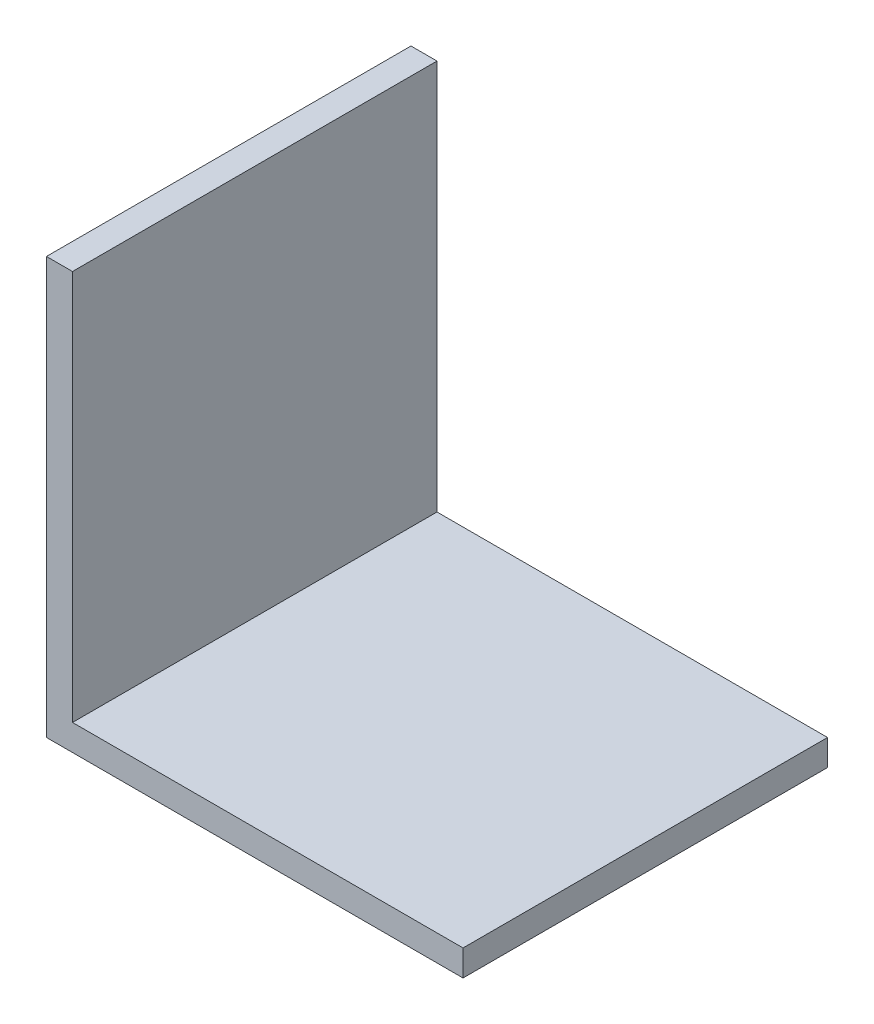
ISO-10303-21;
HEADER;
FILE_DESCRIPTION(('STEP AP214'),'2;1');
FILE_NAME('part.step','',(''),(''),'','','');
FILE_SCHEMA(('AUTOMOTIVE_DESIGN { 1 0 10303 214 1 1 1 1 }'));
ENDSEC;
DATA;
#1=APPLICATION_CONTEXT('core data for automotive mechanical design processes');
#2=APPLICATION_PROTOCOL_DEFINITION('international standard','automotive_design',2000,#1);
#3=PRODUCT_CONTEXT('',#1,'mechanical');
#4=PRODUCT('Part','Part','',(#3));
#5=PRODUCT_RELATED_PRODUCT_CATEGORY('part','',(#4));
#6=PRODUCT_DEFINITION_FORMATION('','',#4);
#7=PRODUCT_DEFINITION_CONTEXT('part definition',#1,'design');
#8=PRODUCT_DEFINITION('design','',#6,#7);
#9=PRODUCT_DEFINITION_SHAPE('','',#8);
#10=(LENGTH_UNIT() NAMED_UNIT(*) SI_UNIT(.MILLI.,.METRE.));
#11=(NAMED_UNIT(*) PLANE_ANGLE_UNIT() SI_UNIT($,.RADIAN.));
#12=(NAMED_UNIT(*) SI_UNIT($,.STERADIAN.) SOLID_ANGLE_UNIT());
#13=UNCERTAINTY_MEASURE_WITH_UNIT(LENGTH_MEASURE(1.E-05),#10,'distance_accuracy_value','');
#14=(GEOMETRIC_REPRESENTATION_CONTEXT(3) GLOBAL_UNCERTAINTY_ASSIGNED_CONTEXT((#13)) GLOBAL_UNIT_ASSIGNED_CONTEXT((#10,
#11,#12)) REPRESENTATION_CONTEXT('',''));
#15=CARTESIAN_POINT('',(0.,0.,0.));
#16=DIRECTION('',(0.,0.,1.));
#17=DIRECTION('',(1.,0.,0.));
#18=AXIS2_PLACEMENT_3D('',#15,#16,#17);
#19=CARTESIAN_POINT('',(76.2,0.,33.3375));
#20=DIRECTION('',(0.,1.,0.));
#21=DIRECTION('',(-1.,0.,0.));
#22=AXIS2_PLACEMENT_3D('',#19,#20,#21);
#23=PLANE('',#22);
#24=DIRECTION('',(1.,0.,0.));
#25=VECTOR('',#24,1.);
#26=CARTESIAN_POINT('',(76.2,0.,-33.3375));
#27=LINE('',#26,#25);
#28=CARTESIAN_POINT('',(0.,0.,-33.3375));
#29=VERTEX_POINT('',#28);
#30=CARTESIAN_POINT('',(76.2,0.,-33.3375));
#31=VERTEX_POINT('',#30);
#32=EDGE_CURVE('E118',#29,#31,#27,.T.);
#33=ORIENTED_EDGE('',*,*,#32,.T.);
#34=DIRECTION('',(0.,0.,-1.));
#35=VECTOR('',#34,1.);
#36=CARTESIAN_POINT('',(76.2,0.,33.3375));
#37=LINE('',#36,#35);
#38=CARTESIAN_POINT('',(76.2,0.,33.3375));
#39=VERTEX_POINT('',#38);
#40=EDGE_CURVE('E11',#39,#31,#37,.T.);
#41=ORIENTED_EDGE('',*,*,#40,.F.);
#42=DIRECTION('',(1.,0.,0.));
#43=VECTOR('',#42,1.);
#44=CARTESIAN_POINT('',(76.2,0.,33.3375));
#45=LINE('',#44,#43);
#46=CARTESIAN_POINT('',(0.,0.,33.3375));
#47=VERTEX_POINT('',#46);
#48=EDGE_CURVE('E128',#47,#39,#45,.T.);
#49=ORIENTED_EDGE('',*,*,#48,.F.);
#50=DIRECTION('',(0.,0.,-1.));
#51=VECTOR('',#50,1.);
#52=CARTESIAN_POINT('',(0.,0.,33.3375));
#53=LINE('',#52,#51);
#54=EDGE_CURVE('E114',#47,#29,#53,.T.);
#55=ORIENTED_EDGE('',*,*,#54,.T.);
#56=EDGE_LOOP('',(#33,#41,#49,#55));
#57=FACE_BOUND('',#56,.T.);
#58=ADVANCED_FACE('F34',(#57),#23,.F.);
#59=CARTESIAN_POINT('',(76.2,4.7625,33.3375));
#60=DIRECTION('',(-1.,0.,0.));
#61=DIRECTION('',(0.,-1.,0.));
#62=AXIS2_PLACEMENT_3D('',#59,#60,#61);
#63=PLANE('',#62);
#64=DIRECTION('',(0.,1.,0.));
#65=VECTOR('',#64,1.);
#66=CARTESIAN_POINT('',(76.2,4.7625,-33.3375));
#67=LINE('',#66,#65);
#68=CARTESIAN_POINT('',(76.2,4.7625,-33.3375));
#69=VERTEX_POINT('',#68);
#70=EDGE_CURVE('E121',#31,#69,#67,.T.);
#71=ORIENTED_EDGE('',*,*,#70,.T.);
#72=DIRECTION('',(0.,0.,-1.));
#73=VECTOR('',#72,1.);
#74=CARTESIAN_POINT('',(76.2,4.7625,33.3375));
#75=LINE('',#74,#73);
#76=CARTESIAN_POINT('',(76.2,4.7625,33.3375));
#77=VERTEX_POINT('',#76);
#78=EDGE_CURVE('E42',#77,#69,#75,.T.);
#79=ORIENTED_EDGE('',*,*,#78,.F.);
#80=DIRECTION('',(0.,1.,0.));
#81=VECTOR('',#80,1.);
#82=CARTESIAN_POINT('',(76.2,4.7625,33.3375));
#83=LINE('',#82,#81);
#84=EDGE_CURVE('E87',#39,#77,#83,.T.);
#85=ORIENTED_EDGE('',*,*,#84,.F.);
#86=ORIENTED_EDGE('',*,*,#40,.T.);
#87=EDGE_LOOP('',(#71,#79,#85,#86));
#88=FACE_BOUND('',#87,.T.);
#89=ADVANCED_FACE('F152',(#88),#63,.F.);
#90=CARTESIAN_POINT('',(4.76250000000001,4.7625,33.3375));
#91=DIRECTION('',(0.,-1.,0.));
#92=DIRECTION('',(0.,0.,-1.));
#93=AXIS2_PLACEMENT_3D('',#90,#91,#92);
#94=PLANE('',#93);
#95=DIRECTION('',(-1.,0.,0.));
#96=VECTOR('',#95,1.);
#97=CARTESIAN_POINT('',(4.76250000000001,4.7625,-33.3375));
#98=LINE('',#97,#96);
#99=CARTESIAN_POINT('',(4.76250000000001,4.7625,-33.3375));
#100=VERTEX_POINT('',#99);
#101=EDGE_CURVE('E123',#69,#100,#98,.T.);
#102=ORIENTED_EDGE('',*,*,#101,.T.);
#103=DIRECTION('',(0.,0.,-1.));
#104=VECTOR('',#103,1.);
#105=CARTESIAN_POINT('',(4.76250000000001,4.7625,33.3375));
#106=LINE('',#105,#104);
#107=CARTESIAN_POINT('',(4.76250000000001,4.7625,33.3375));
#108=VERTEX_POINT('',#107);
#109=EDGE_CURVE('E109',#108,#100,#106,.T.);
#110=ORIENTED_EDGE('',*,*,#109,.F.);
#111=DIRECTION('',(-1.,0.,0.));
#112=VECTOR('',#111,1.);
#113=CARTESIAN_POINT('',(4.76250000000001,4.7625,33.3375));
#114=LINE('',#113,#112);
#115=EDGE_CURVE('E100',#77,#108,#114,.T.);
#116=ORIENTED_EDGE('',*,*,#115,.F.);
#117=ORIENTED_EDGE('',*,*,#78,.T.);
#118=EDGE_LOOP('',(#102,#110,#116,#117));
#119=FACE_BOUND('',#118,.T.);
#120=ADVANCED_FACE('F134',(#119),#94,.F.);
#121=CARTESIAN_POINT('',(4.7625,76.2,33.3375));
#122=DIRECTION('',(-1.,0.,0.));
#123=DIRECTION('',(0.,-1.,0.));
#124=AXIS2_PLACEMENT_3D('',#121,#122,#123);
#125=PLANE('',#124);
#126=DIRECTION('',(0.,1.,0.));
#127=VECTOR('',#126,1.);
#128=CARTESIAN_POINT('',(4.7625,76.2,-33.3375));
#129=LINE('',#128,#127);
#130=CARTESIAN_POINT('',(4.7625,76.2,-33.3375));
#131=VERTEX_POINT('',#130);
#132=EDGE_CURVE('E108',#100,#131,#129,.T.);
#133=ORIENTED_EDGE('',*,*,#132,.T.);
#134=DIRECTION('',(0.,0.,-1.));
#135=VECTOR('',#134,1.);
#136=CARTESIAN_POINT('',(4.7625,76.2,33.3375));
#137=LINE('',#136,#135);
#138=CARTESIAN_POINT('',(4.7625,76.2,33.3375));
#139=VERTEX_POINT('',#138);
#140=EDGE_CURVE('E105',#139,#131,#137,.T.);
#141=ORIENTED_EDGE('',*,*,#140,.F.);
#142=DIRECTION('',(0.,1.,0.));
#143=VECTOR('',#142,1.);
#144=CARTESIAN_POINT('',(4.7625,76.2,33.3375));
#145=LINE('',#144,#143);
#146=EDGE_CURVE('E94',#108,#139,#145,.T.);
#147=ORIENTED_EDGE('',*,*,#146,.F.);
#148=ORIENTED_EDGE('',*,*,#109,.T.);
#149=EDGE_LOOP('',(#133,#141,#147,#148));
#150=FACE_BOUND('',#149,.T.);
#151=ADVANCED_FACE('F106',(#150),#125,.F.);
#152=CARTESIAN_POINT('',(0.,76.2,33.3375));
#153=DIRECTION('',(0.,-1.,0.));
#154=DIRECTION('',(0.,0.,-1.));
#155=AXIS2_PLACEMENT_3D('',#152,#153,#154);
#156=PLANE('',#155);
#157=DIRECTION('',(-1.,0.,0.));
#158=VECTOR('',#157,1.);
#159=CARTESIAN_POINT('',(0.,76.2,-33.3375));
#160=LINE('',#159,#158);
#161=CARTESIAN_POINT('',(0.,76.2,-33.3375));
#162=VERTEX_POINT('',#161);
#163=EDGE_CURVE('E73',#131,#162,#160,.T.);
#164=ORIENTED_EDGE('',*,*,#163,.T.);
#165=DIRECTION('',(0.,0.,-1.));
#166=VECTOR('',#165,1.);
#167=CARTESIAN_POINT('',(0.,76.2,33.3375));
#168=LINE('',#167,#166);
#169=CARTESIAN_POINT('',(0.,76.2,33.3375));
#170=VERTEX_POINT('',#169);
#171=EDGE_CURVE('E110',#170,#162,#168,.T.);
#172=ORIENTED_EDGE('',*,*,#171,.F.);
#173=DIRECTION('',(-1.,0.,0.));
#174=VECTOR('',#173,1.);
#175=CARTESIAN_POINT('',(0.,76.2,33.3375));
#176=LINE('',#175,#174);
#177=EDGE_CURVE('E98',#139,#170,#176,.T.);
#178=ORIENTED_EDGE('',*,*,#177,.F.);
#179=ORIENTED_EDGE('',*,*,#140,.T.);
#180=EDGE_LOOP('',(#164,#172,#178,#179));
#181=FACE_BOUND('',#180,.T.);
#182=ADVANCED_FACE('F112',(#181),#156,.F.);
#183=CARTESIAN_POINT('',(0.,0.,33.3375));
#184=DIRECTION('',(1.,0.,0.));
#185=DIRECTION('',(0.,0.,-1.));
#186=AXIS2_PLACEMENT_3D('',#183,#184,#185);
#187=PLANE('',#186);
#188=DIRECTION('',(0.,-1.,0.));
#189=VECTOR('',#188,1.);
#190=CARTESIAN_POINT('',(0.,0.,-33.3375));
#191=LINE('',#190,#189);
#192=EDGE_CURVE('E79',#162,#29,#191,.T.);
#193=ORIENTED_EDGE('',*,*,#192,.T.);
#194=ORIENTED_EDGE('',*,*,#54,.F.);
#195=DIRECTION('',(0.,-1.,0.));
#196=VECTOR('',#195,1.);
#197=CARTESIAN_POINT('',(0.,0.,33.3375));
#198=LINE('',#197,#196);
#199=EDGE_CURVE('E50',#170,#47,#198,.T.);
#200=ORIENTED_EDGE('',*,*,#199,.F.);
#201=ORIENTED_EDGE('',*,*,#171,.T.);
#202=EDGE_LOOP('',(#193,#194,#200,#201));
#203=FACE_BOUND('',#202,.T.);
#204=ADVANCED_FACE('F141',(#203),#187,.F.);
#205=CARTESIAN_POINT('',(0.,0.,33.3375));
#206=DIRECTION('',(0.,0.,-1.));
#207=DIRECTION('',(-1.,0.,0.));
#208=AXIS2_PLACEMENT_3D('',#205,#206,#207);
#209=PLANE('',#208);
#210=ORIENTED_EDGE('',*,*,#48,.T.);
#211=ORIENTED_EDGE('',*,*,#84,.T.);
#212=ORIENTED_EDGE('',*,*,#115,.T.);
#213=ORIENTED_EDGE('',*,*,#146,.T.);
#214=ORIENTED_EDGE('',*,*,#177,.T.);
#215=ORIENTED_EDGE('',*,*,#199,.T.);
#216=EDGE_LOOP('',(#210,#211,#212,#213,#214,#215));
#217=FACE_BOUND('',#216,.T.);
#218=ADVANCED_FACE('F96',(#217),#209,.F.);
#219=CARTESIAN_POINT('',(0.,0.,-33.3375));
#220=DIRECTION('',(0.,0.,-1.));
#221=DIRECTION('',(-1.,0.,0.));
#222=AXIS2_PLACEMENT_3D('',#219,#220,#221);
#223=PLANE('',#222);
#224=ORIENTED_EDGE('',*,*,#32,.F.);
#225=ORIENTED_EDGE('',*,*,#192,.F.);
#226=ORIENTED_EDGE('',*,*,#163,.F.);
#227=ORIENTED_EDGE('',*,*,#132,.F.);
#228=ORIENTED_EDGE('',*,*,#101,.F.);
#229=ORIENTED_EDGE('',*,*,#70,.F.);
#230=EDGE_LOOP('',(#224,#225,#226,#227,#228,#229));
#231=FACE_BOUND('',#230,.T.);
#232=ADVANCED_FACE('F137',(#231),#223,.T.);
#233=CLOSED_SHELL('',(#58,#89,#120,#151,#182,#204,#218,#232));
#234=MANIFOLD_SOLID_BREP('B2',#233);
#235=ADVANCED_BREP_SHAPE_REPRESENTATION('',(#18,#234),#14);
#236=SHAPE_DEFINITION_REPRESENTATION(#9,#235);
ENDSEC;
END-ISO-10303-21;
